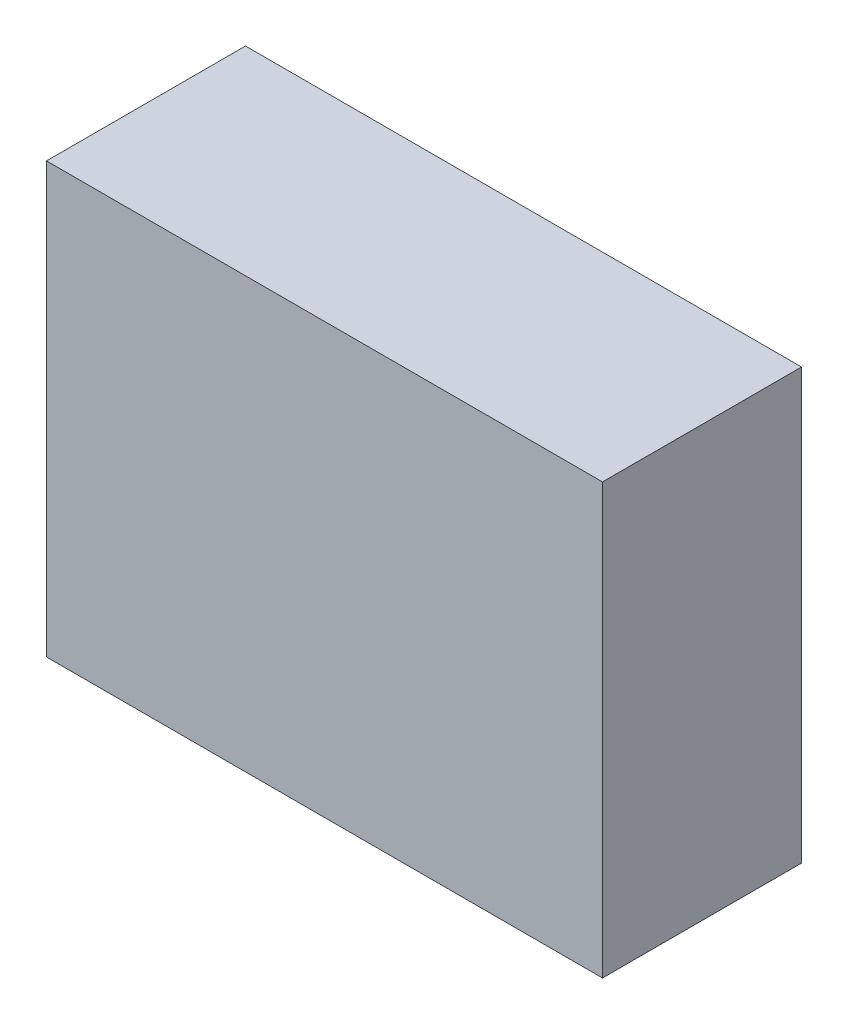
ISO-10303-21;
HEADER;
FILE_DESCRIPTION(('STEP AP214'),'2;1');
FILE_NAME('part.step','',(''),(''),'','','');
FILE_SCHEMA(('AUTOMOTIVE_DESIGN { 1 0 10303 214 1 1 1 1 }'));
ENDSEC;
DATA;
#1=APPLICATION_CONTEXT('core data for automotive mechanical design processes');
#2=APPLICATION_PROTOCOL_DEFINITION('international standard','automotive_design',2000,#1);
#3=PRODUCT_CONTEXT('',#1,'mechanical');
#4=PRODUCT('Part','Part','',(#3));
#5=PRODUCT_RELATED_PRODUCT_CATEGORY('part','',(#4));
#6=PRODUCT_DEFINITION_FORMATION('','',#4);
#7=PRODUCT_DEFINITION_CONTEXT('part definition',#1,'design');
#8=PRODUCT_DEFINITION('design','',#6,#7);
#9=PRODUCT_DEFINITION_SHAPE('','',#8);
#10=(LENGTH_UNIT() NAMED_UNIT(*) SI_UNIT(.MILLI.,.METRE.));
#11=(NAMED_UNIT(*) PLANE_ANGLE_UNIT() SI_UNIT($,.RADIAN.));
#12=(NAMED_UNIT(*) SI_UNIT($,.STERADIAN.) SOLID_ANGLE_UNIT());
#13=UNCERTAINTY_MEASURE_WITH_UNIT(LENGTH_MEASURE(1.E-05),#10,'distance_accuracy_value','');
#14=(GEOMETRIC_REPRESENTATION_CONTEXT(3) GLOBAL_UNCERTAINTY_ASSIGNED_CONTEXT((#13)) GLOBAL_UNIT_ASSIGNED_CONTEXT((#10,
#11,#12)) REPRESENTATION_CONTEXT('',''));
#15=CARTESIAN_POINT('',(0.,0.,0.));
#16=DIRECTION('',(0.,0.,1.));
#17=DIRECTION('',(1.,0.,0.));
#18=AXIS2_PLACEMENT_3D('',#15,#16,#17);
#19=CARTESIAN_POINT('',(0.,0.,0.1999996));
#20=DIRECTION('',(0.,0.,1.));
#21=DIRECTION('',(1.,0.,0.));
#22=AXIS2_PLACEMENT_3D('',#19,#20,#21);
#23=PLANE('',#22);
#24=DIRECTION('',(0.,-1.,0.));
#25=VECTOR('',#24,1.);
#26=CARTESIAN_POINT('',(-0.2794,0.2159,0.1999996));
#27=LINE('',#26,#25);
#28=CARTESIAN_POINT('',(-0.2794,0.2159,0.1999996));
#29=VERTEX_POINT('',#28);
#30=CARTESIAN_POINT('',(-0.2794,-0.2159,0.1999996));
#31=VERTEX_POINT('',#30);
#32=EDGE_CURVE('E82',#29,#31,#27,.T.);
#33=ORIENTED_EDGE('',*,*,#32,.T.);
#34=DIRECTION('',(1.,0.,0.));
#35=VECTOR('',#34,1.);
#36=CARTESIAN_POINT('',(-0.2794,-0.2159,0.1999996));
#37=LINE('',#36,#35);
#38=CARTESIAN_POINT('',(0.2794,-0.2159,0.1999996));
#39=VERTEX_POINT('',#38);
#40=EDGE_CURVE('E107',#31,#39,#37,.T.);
#41=ORIENTED_EDGE('',*,*,#40,.T.);
#42=DIRECTION('',(0.,1.,0.));
#43=VECTOR('',#42,1.);
#44=CARTESIAN_POINT('',(0.2794,-0.2159,0.1999996));
#45=LINE('',#44,#43);
#46=CARTESIAN_POINT('',(0.2794,0.2159,0.1999996));
#47=VERTEX_POINT('',#46);
#48=EDGE_CURVE('E74',#39,#47,#45,.T.);
#49=ORIENTED_EDGE('',*,*,#48,.T.);
#50=DIRECTION('',(-1.,0.,0.));
#51=VECTOR('',#50,1.);
#52=CARTESIAN_POINT('',(0.2794,0.2159,0.1999996));
#53=LINE('',#52,#51);
#54=EDGE_CURVE('E11',#47,#29,#53,.T.);
#55=ORIENTED_EDGE('',*,*,#54,.T.);
#56=EDGE_LOOP('',(#33,#41,#49,#55));
#57=FACE_BOUND('',#56,.T.);
#58=ADVANCED_FACE('F17',(#57),#23,.T.);
#59=CARTESIAN_POINT('',(0.,0.,0.));
#60=DIRECTION('',(0.,0.,1.));
#61=DIRECTION('',(1.,0.,0.));
#62=AXIS2_PLACEMENT_3D('',#59,#60,#61);
#63=PLANE('',#62);
#64=DIRECTION('',(-1.,0.,0.));
#65=VECTOR('',#64,1.);
#66=CARTESIAN_POINT('',(0.2794,0.2159,0.));
#67=LINE('',#66,#65);
#68=CARTESIAN_POINT('',(0.2794,0.2159,0.));
#69=VERTEX_POINT('',#68);
#70=CARTESIAN_POINT('',(-0.2794,0.2159,0.));
#71=VERTEX_POINT('',#70);
#72=EDGE_CURVE('E25',#69,#71,#67,.T.);
#73=ORIENTED_EDGE('',*,*,#72,.F.);
#74=DIRECTION('',(0.,1.,0.));
#75=VECTOR('',#74,1.);
#76=CARTESIAN_POINT('',(0.2794,-0.2159,0.));
#77=LINE('',#76,#75);
#78=CARTESIAN_POINT('',(0.2794,-0.2159,0.));
#79=VERTEX_POINT('',#78);
#80=EDGE_CURVE('E103',#79,#69,#77,.T.);
#81=ORIENTED_EDGE('',*,*,#80,.F.);
#82=DIRECTION('',(1.,0.,0.));
#83=VECTOR('',#82,1.);
#84=CARTESIAN_POINT('',(-0.2794,-0.2159,0.));
#85=LINE('',#84,#83);
#86=CARTESIAN_POINT('',(-0.2794,-0.2159,0.));
#87=VERTEX_POINT('',#86);
#88=EDGE_CURVE('E84',#87,#79,#85,.T.);
#89=ORIENTED_EDGE('',*,*,#88,.F.);
#90=DIRECTION('',(0.,-1.,0.));
#91=VECTOR('',#90,1.);
#92=CARTESIAN_POINT('',(-0.2794,0.2159,0.));
#93=LINE('',#92,#91);
#94=EDGE_CURVE('E80',#71,#87,#93,.T.);
#95=ORIENTED_EDGE('',*,*,#94,.F.);
#96=EDGE_LOOP('',(#73,#81,#89,#95));
#97=FACE_BOUND('',#96,.T.);
#98=ADVANCED_FACE('F86',(#97),#63,.F.);
#99=CARTESIAN_POINT('',(0.2794,0.2159,0.));
#100=DIRECTION('',(0.,-1.,0.));
#101=DIRECTION('',(0.,0.,-1.));
#102=AXIS2_PLACEMENT_3D('',#99,#100,#101);
#103=PLANE('',#102);
#104=ORIENTED_EDGE('',*,*,#72,.T.);
#105=DIRECTION('',(0.,0.,1.));
#106=VECTOR('',#105,1.);
#107=CARTESIAN_POINT('',(-0.2794,0.2159,0.));
#108=LINE('',#107,#106);
#109=EDGE_CURVE('E68',#71,#29,#108,.T.);
#110=ORIENTED_EDGE('',*,*,#109,.T.);
#111=ORIENTED_EDGE('',*,*,#54,.F.);
#112=DIRECTION('',(0.,0.,1.));
#113=VECTOR('',#112,1.);
#114=CARTESIAN_POINT('',(0.2794,0.2159,0.));
#115=LINE('',#114,#113);
#116=EDGE_CURVE('E71',#69,#47,#115,.T.);
#117=ORIENTED_EDGE('',*,*,#116,.F.);
#118=EDGE_LOOP('',(#104,#110,#111,#117));
#119=FACE_BOUND('',#118,.T.);
#120=ADVANCED_FACE('F67',(#119),#103,.F.);
#121=CARTESIAN_POINT('',(0.2794,-0.2159,0.));
#122=DIRECTION('',(-1.,0.,0.));
#123=DIRECTION('',(0.,0.,1.));
#124=AXIS2_PLACEMENT_3D('',#121,#122,#123);
#125=PLANE('',#124);
#126=ORIENTED_EDGE('',*,*,#80,.T.);
#127=ORIENTED_EDGE('',*,*,#116,.T.);
#128=ORIENTED_EDGE('',*,*,#48,.F.);
#129=DIRECTION('',(0.,0.,1.));
#130=VECTOR('',#129,1.);
#131=CARTESIAN_POINT('',(0.2794,-0.2159,0.));
#132=LINE('',#131,#130);
#133=EDGE_CURVE('E100',#79,#39,#132,.T.);
#134=ORIENTED_EDGE('',*,*,#133,.F.);
#135=EDGE_LOOP('',(#126,#127,#128,#134));
#136=FACE_BOUND('',#135,.T.);
#137=ADVANCED_FACE('F117',(#136),#125,.F.);
#138=CARTESIAN_POINT('',(-0.2794,-0.2159,0.));
#139=DIRECTION('',(0.,1.,0.));
#140=DIRECTION('',(1.,0.,0.));
#141=AXIS2_PLACEMENT_3D('',#138,#139,#140);
#142=PLANE('',#141);
#143=ORIENTED_EDGE('',*,*,#88,.T.);
#144=ORIENTED_EDGE('',*,*,#133,.T.);
#145=ORIENTED_EDGE('',*,*,#40,.F.);
#146=DIRECTION('',(0.,0.,1.));
#147=VECTOR('',#146,1.);
#148=CARTESIAN_POINT('',(-0.2794,-0.2159,0.));
#149=LINE('',#148,#147);
#150=EDGE_CURVE('E90',#87,#31,#149,.T.);
#151=ORIENTED_EDGE('',*,*,#150,.F.);
#152=EDGE_LOOP('',(#143,#144,#145,#151));
#153=FACE_BOUND('',#152,.T.);
#154=ADVANCED_FACE('F119',(#153),#142,.F.);
#155=CARTESIAN_POINT('',(-0.2794,0.2159,0.));
#156=DIRECTION('',(1.,0.,0.));
#157=DIRECTION('',(0.,1.,0.));
#158=AXIS2_PLACEMENT_3D('',#155,#156,#157);
#159=PLANE('',#158);
#160=ORIENTED_EDGE('',*,*,#94,.T.);
#161=ORIENTED_EDGE('',*,*,#150,.T.);
#162=ORIENTED_EDGE('',*,*,#32,.F.);
#163=ORIENTED_EDGE('',*,*,#109,.F.);
#164=EDGE_LOOP('',(#160,#161,#162,#163));
#165=FACE_BOUND('',#164,.T.);
#166=ADVANCED_FACE('F78',(#165),#159,.F.);
#167=CLOSED_SHELL('',(#58,#98,#120,#137,#154,#166));
#168=MANIFOLD_SOLID_BREP('B1',#167);
#169=ADVANCED_BREP_SHAPE_REPRESENTATION('',(#18,#168),#14);
#170=SHAPE_DEFINITION_REPRESENTATION(#9,#169);
ENDSEC;
END-ISO-10303-21;
